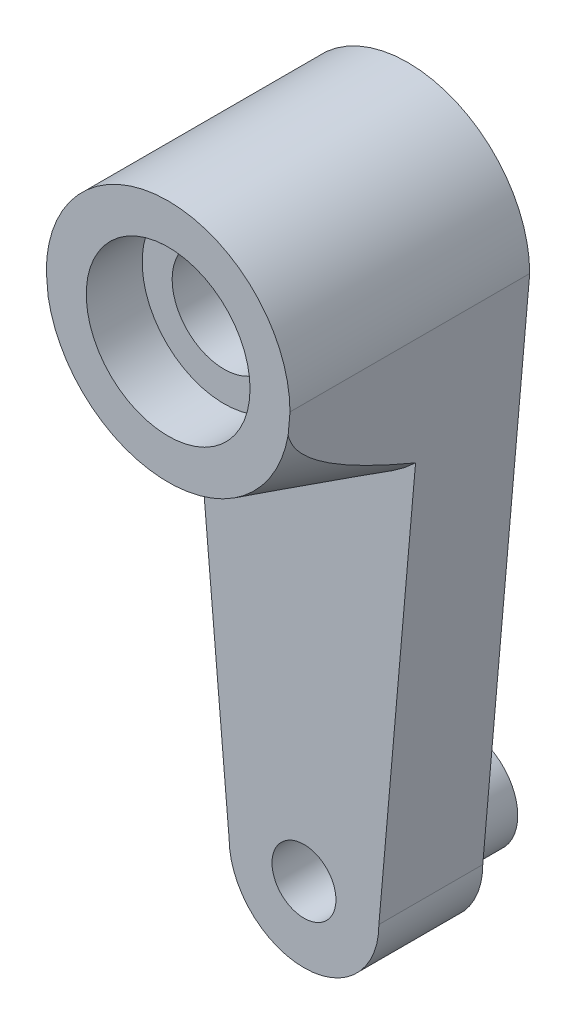
ISO-10303-21;
HEADER;
FILE_DESCRIPTION(('STEP AP214'),'2;1');
FILE_NAME('part.step','',(''),(''),'','','');
FILE_SCHEMA(('AUTOMOTIVE_DESIGN { 1 0 10303 214 1 1 1 1 }'));
ENDSEC;
DATA;
#1=APPLICATION_CONTEXT('core data for automotive mechanical design processes');
#2=APPLICATION_PROTOCOL_DEFINITION('international standard','automotive_design',2000,#1);
#3=PRODUCT_CONTEXT('',#1,'mechanical');
#4=PRODUCT('Part','Part','',(#3));
#5=PRODUCT_RELATED_PRODUCT_CATEGORY('part','',(#4));
#6=PRODUCT_DEFINITION_FORMATION('','',#4);
#7=PRODUCT_DEFINITION_CONTEXT('part definition',#1,'design');
#8=PRODUCT_DEFINITION('design','',#6,#7);
#9=PRODUCT_DEFINITION_SHAPE('','',#8);
#10=(LENGTH_UNIT() NAMED_UNIT(*) SI_UNIT(.MILLI.,.METRE.));
#11=(NAMED_UNIT(*) PLANE_ANGLE_UNIT() SI_UNIT($,.RADIAN.));
#12=(NAMED_UNIT(*) SI_UNIT($,.STERADIAN.) SOLID_ANGLE_UNIT());
#13=UNCERTAINTY_MEASURE_WITH_UNIT(LENGTH_MEASURE(1.E-05),#10,'distance_accuracy_value','');
#14=(GEOMETRIC_REPRESENTATION_CONTEXT(3) GLOBAL_UNCERTAINTY_ASSIGNED_CONTEXT((#13)) GLOBAL_UNIT_ASSIGNED_CONTEXT((#10,
#11,#12)) REPRESENTATION_CONTEXT('',''));
#15=CARTESIAN_POINT('',(0.,0.,0.));
#16=DIRECTION('',(0.,0.,1.));
#17=DIRECTION('',(1.,0.,0.));
#18=AXIS2_PLACEMENT_3D('',#15,#16,#17);
#19=CARTESIAN_POINT('',(0.,0.,12.));
#20=DIRECTION('',(0.,0.,-1.));
#21=DIRECTION('',(-1.,0.,0.));
#22=AXIS2_PLACEMENT_3D('',#19,#20,#21);
#23=CYLINDRICAL_SURFACE('',#22,2.6);
#24=CARTESIAN_POINT('',(0.,0.,2.8));
#25=DIRECTION('',(0.,0.,-1.));
#26=DIRECTION('',(-1.,0.,0.));
#27=AXIS2_PLACEMENT_3D('',#24,#25,#26);
#28=CIRCLE('',#27,2.6);
#29=CARTESIAN_POINT('',(-2.6,0.,2.8));
#30=VERTEX_POINT('',#29);
#31=EDGE_CURVE('E134',#30,#30,#28,.T.);
#32=ORIENTED_EDGE('',*,*,#31,.T.);
#33=EDGE_LOOP('',(#32));
#34=FACE_BOUND('',#33,.T.);
#35=CARTESIAN_POINT('',(0.,0.,9.2));
#36=DIRECTION('',(0.,0.,1.));
#37=DIRECTION('',(1.,0.,0.));
#38=AXIS2_PLACEMENT_3D('',#35,#36,#37);
#39=CIRCLE('',#38,2.6);
#40=CARTESIAN_POINT('',(2.6,0.,9.2));
#41=VERTEX_POINT('',#40);
#42=EDGE_CURVE('E265',#41,#41,#39,.T.);
#43=ORIENTED_EDGE('',*,*,#42,.T.);
#44=EDGE_LOOP('',(#43));
#45=FACE_BOUND('',#44,.T.);
#46=ADVANCED_FACE('F35',(#34,#45),#23,.F.);
#47=CARTESIAN_POINT('',(0.,-26.8,0.));
#48=DIRECTION('',(0.,0.,1.));
#49=DIRECTION('',(1.,0.,0.));
#50=AXIS2_PLACEMENT_3D('',#47,#48,#49);
#51=PLANE('',#50);
#52=CARTESIAN_POINT('',(0.,-26.8,0.));
#53=DIRECTION('',(0.,0.,1.));
#54=DIRECTION('',(1.,0.,0.));
#55=AXIS2_PLACEMENT_3D('',#52,#53,#54);
#56=CIRCLE('',#55,3.);
#57=CARTESIAN_POINT('',(3.,-26.8,0.));
#58=VERTEX_POINT('',#57);
#59=EDGE_CURVE('E140',#58,#58,#56,.T.);
#60=ORIENTED_EDGE('',*,*,#59,.T.);
#61=EDGE_LOOP('',(#60));
#62=FACE_BOUND('',#61,.T.);
#63=CARTESIAN_POINT('',(0.,-26.8,0.));
#64=DIRECTION('',(0.,0.,1.));
#65=DIRECTION('',(1.,0.,0.));
#66=AXIS2_PLACEMENT_3D('',#63,#64,#65);
#67=CIRCLE('',#66,3.75);
#68=CARTESIAN_POINT('',(-3.75,-26.8,0.));
#69=VERTEX_POINT('',#68);
#70=CARTESIAN_POINT('',(3.75,-26.8,0.));
#71=VERTEX_POINT('',#70);
#72=EDGE_CURVE('E133',#69,#71,#67,.T.);
#73=ORIENTED_EDGE('',*,*,#72,.F.);
#74=DIRECTION('',(0.0873513906763996,-0.996177561756386,0.));
#75=VECTOR('',#74,1.);
#76=CARTESIAN_POINT('',(-3.75,-26.8,0.));
#77=LINE('',#76,#75);
#78=CARTESIAN_POINT('',(-6.1,0.,0.));
#79=VERTEX_POINT('',#78);
#80=EDGE_CURVE('E113',#79,#69,#77,.T.);
#81=ORIENTED_EDGE('',*,*,#80,.F.);
#82=CARTESIAN_POINT('',(0.,0.,0.));
#83=DIRECTION('',(0.,0.,1.));
#84=DIRECTION('',(1.,0.,0.));
#85=AXIS2_PLACEMENT_3D('',#82,#83,#84);
#86=CIRCLE('',#85,6.1);
#87=CARTESIAN_POINT('',(6.1,0.,0.));
#88=VERTEX_POINT('',#87);
#89=EDGE_CURVE('E255',#88,#79,#86,.T.);
#90=ORIENTED_EDGE('',*,*,#89,.F.);
#91=DIRECTION('',(0.0873513906763996,0.996177561756386,0.));
#92=VECTOR('',#91,1.);
#93=CARTESIAN_POINT('',(6.1,0.,0.));
#94=LINE('',#93,#92);
#95=EDGE_CURVE('E254',#71,#88,#94,.T.);
#96=ORIENTED_EDGE('',*,*,#95,.F.);
#97=EDGE_LOOP('',(#73,#81,#90,#96));
#98=FACE_BOUND('',#97,.T.);
#99=CARTESIAN_POINT('',(0.,0.,0.));
#100=DIRECTION('',(0.,0.,-1.));
#101=DIRECTION('',(-1.,0.,0.));
#102=AXIS2_PLACEMENT_3D('',#99,#100,#101);
#103=CIRCLE('',#102,4.1);
#104=CARTESIAN_POINT('',(-4.1,0.,0.));
#105=VERTEX_POINT('',#104);
#106=EDGE_CURVE('E241',#105,#105,#103,.T.);
#107=ORIENTED_EDGE('',*,*,#106,.F.);
#108=EDGE_LOOP('',(#107));
#109=FACE_BOUND('',#108,.T.);
#110=ADVANCED_FACE('F152',(#62,#98,#109),#51,.F.);
#111=CARTESIAN_POINT('',(0.,-26.8,12.));
#112=DIRECTION('',(0.,0.,-1.));
#113=DIRECTION('',(-1.,0.,0.));
#114=AXIS2_PLACEMENT_3D('',#111,#112,#113);
#115=CYLINDRICAL_SURFACE('',#114,3.75);
#116=CARTESIAN_POINT('',(0.,-26.8,5.2));
#117=DIRECTION('',(0.,0.,1.));
#118=DIRECTION('',(1.,0.,0.));
#119=AXIS2_PLACEMENT_3D('',#116,#117,#118);
#120=CIRCLE('',#119,3.75);
#121=CARTESIAN_POINT('',(-3.75,-26.8,5.2));
#122=VERTEX_POINT('',#121);
#123=CARTESIAN_POINT('',(3.75,-26.8,5.2));
#124=VERTEX_POINT('',#123);
#125=EDGE_CURVE('E95',#122,#124,#120,.T.);
#126=ORIENTED_EDGE('',*,*,#125,.F.);
#127=DIRECTION('',(0.,0.,-1.));
#128=VECTOR('',#127,1.);
#129=CARTESIAN_POINT('',(-3.75,-26.8,12.));
#130=LINE('',#129,#128);
#131=EDGE_CURVE('E105',#122,#69,#130,.T.);
#132=ORIENTED_EDGE('',*,*,#131,.T.);
#133=ORIENTED_EDGE('',*,*,#72,.T.);
#134=DIRECTION('',(0.,0.,-1.));
#135=VECTOR('',#134,1.);
#136=CARTESIAN_POINT('',(3.75,-26.8,12.));
#137=LINE('',#136,#135);
#138=EDGE_CURVE('E107',#124,#71,#137,.T.);
#139=ORIENTED_EDGE('',*,*,#138,.F.);
#140=EDGE_LOOP('',(#126,#132,#133,#139));
#141=FACE_BOUND('',#140,.T.);
#142=ADVANCED_FACE('F103',(#141),#115,.T.);
#143=CARTESIAN_POINT('',(0.,-26.8,12.));
#144=DIRECTION('',(0.,0.,-1.));
#145=DIRECTION('',(-1.,0.,0.));
#146=AXIS2_PLACEMENT_3D('',#143,#144,#145);
#147=CYLINDRICAL_SURFACE('',#146,1.6);
#148=CARTESIAN_POINT('',(0.,-26.8,5.2));
#149=DIRECTION('',(0.,0.,1.));
#150=DIRECTION('',(1.,0.,0.));
#151=AXIS2_PLACEMENT_3D('',#148,#149,#150);
#152=CIRCLE('',#151,1.6);
#153=CARTESIAN_POINT('',(1.6,-26.8,5.2));
#154=VERTEX_POINT('',#153);
#155=EDGE_CURVE('E130',#154,#154,#152,.T.);
#156=ORIENTED_EDGE('',*,*,#155,.T.);
#157=EDGE_LOOP('',(#156));
#158=FACE_BOUND('',#157,.T.);
#159=CARTESIAN_POINT('',(0.,-26.8,-3.));
#160=DIRECTION('',(0.,0.,-1.));
#161=DIRECTION('',(-1.,0.,0.));
#162=AXIS2_PLACEMENT_3D('',#159,#160,#161);
#163=CIRCLE('',#162,1.6);
#164=CARTESIAN_POINT('',(-1.6,-26.8,-3.));
#165=VERTEX_POINT('',#164);
#166=EDGE_CURVE('E235',#165,#165,#163,.T.);
#167=ORIENTED_EDGE('',*,*,#166,.T.);
#168=EDGE_LOOP('',(#167));
#169=FACE_BOUND('',#168,.T.);
#170=ADVANCED_FACE('F162',(#158,#169),#147,.F.);
#171=CARTESIAN_POINT('',(0.,-26.8,12.));
#172=DIRECTION('',(0.,0.,1.));
#173=DIRECTION('',(1.,0.,0.));
#174=AXIS2_PLACEMENT_3D('',#171,#172,#173);
#175=PLANE('',#174);
#176=CARTESIAN_POINT('',(0.,0.,12.));
#177=DIRECTION('',(0.,0.,1.));
#178=DIRECTION('',(1.,0.,0.));
#179=AXIS2_PLACEMENT_3D('',#176,#177,#178);
#180=CIRCLE('',#179,4.1);
#181=CARTESIAN_POINT('',(4.1,0.,12.));
#182=VERTEX_POINT('',#181);
#183=EDGE_CURVE('E200',#182,#182,#180,.T.);
#184=ORIENTED_EDGE('',*,*,#183,.F.);
#185=EDGE_LOOP('',(#184));
#186=FACE_BOUND('',#185,.T.);
#187=CARTESIAN_POINT('',(0.,0.,12.));
#188=DIRECTION('',(0.,0.,-1.));
#189=DIRECTION('',(1.,0.,0.));
#190=AXIS2_PLACEMENT_3D('',#187,#188,#189);
#191=CIRCLE('',#190,6.1);
#192=CARTESIAN_POINT('',(6.00691076147217,-1.06161344363654,12.));
#193=VERTEX_POINT('',#192);
#194=CARTESIAN_POINT('',(-6.00691076147216,-1.06161344363656,12.));
#195=VERTEX_POINT('',#194);
#196=EDGE_CURVE('E99',#193,#195,#191,.T.);
#197=ORIENTED_EDGE('',*,*,#196,.F.);
#198=DIRECTION('',(0.0873513906763996,0.996177561756386,0.));
#199=VECTOR('',#198,1.);
#200=CARTESIAN_POINT('',(6.1,0.,12.));
#201=LINE('',#200,#199);
#202=CARTESIAN_POINT('',(6.1,0.,12.));
#203=VERTEX_POINT('',#202);
#204=EDGE_CURVE('E201',#193,#203,#201,.T.);
#205=ORIENTED_EDGE('',*,*,#204,.T.);
#206=CARTESIAN_POINT('',(0.,0.,12.));
#207=DIRECTION('',(0.,0.,1.));
#208=DIRECTION('',(1.,0.,0.));
#209=AXIS2_PLACEMENT_3D('',#206,#207,#208);
#210=CIRCLE('',#209,6.1);
#211=CARTESIAN_POINT('',(-6.1,0.,12.));
#212=VERTEX_POINT('',#211);
#213=EDGE_CURVE('E121',#203,#212,#210,.T.);
#214=ORIENTED_EDGE('',*,*,#213,.T.);
#215=DIRECTION('',(0.0873513906763996,-0.996177561756386,0.));
#216=VECTOR('',#215,1.);
#217=CARTESIAN_POINT('',(-3.75,-26.8,12.));
#218=LINE('',#217,#216);
#219=EDGE_CURVE('E116',#212,#195,#218,.T.);
#220=ORIENTED_EDGE('',*,*,#219,.T.);
#221=EDGE_LOOP('',(#197,#205,#214,#220));
#222=FACE_BOUND('',#221,.T.);
#223=ADVANCED_FACE('F160',(#186,#222),#175,.T.);
#224=CARTESIAN_POINT('',(6.1,0.,12.));
#225=DIRECTION('',(-0.996177561756386,0.0873513906763996,0.));
#226=DIRECTION('',(-0.0873513906763996,-0.996177561756386,0.));
#227=AXIS2_PLACEMENT_3D('',#224,#225,#226);
#228=PLANE('',#227);
#229=ORIENTED_EDGE('',*,*,#204,.F.);
#230=CARTESIAN_POINT('',(6.00691076147217,-1.06161344363654,11.9999999999999));
#231=CARTESIAN_POINT('',(5.99959290657591,-1.14506812926192,11.9751362120785));
#232=CARTESIAN_POINT('',(5.99243235980993,-1.22672883280593,11.9449550579355));
#233=CARTESIAN_POINT('',(5.97847258999629,-1.38592961195724,11.8758799471729));
#234=CARTESIAN_POINT('',(5.9716719683851,-1.4634856371401,11.8370233346673));
#235=CARTESIAN_POINT('',(5.95206059900039,-1.68713870076145,11.7116434654855));
#236=CARTESIAN_POINT('',(5.93974067235911,-1.8276382896918,11.6151440803784));
#237=CARTESIAN_POINT('',(5.91544789226449,-2.10467935630285,11.3977095441892));
#238=CARTESIAN_POINT('',(5.90356521581586,-2.2401924323979,11.2755087663683));
#239=CARTESIAN_POINT('',(5.88086373731854,-2.49908588930344,11.0186654610849));
#240=CARTESIAN_POINT('',(5.87004637830578,-2.6224498133639,10.8840065241381));
#241=CARTESIAN_POINT('',(5.84895494164729,-2.86298194206493,10.6024445651832));
#242=CARTESIAN_POINT('',(5.83870594811579,-2.97986408106249,10.4552988427259));
#243=CARTESIAN_POINT('',(5.81891825837843,-3.2055279470034,10.155098552462));
#244=CARTESIAN_POINT('',(5.80937907159271,-3.31431526864486,10.0020481788366));
#245=CARTESIAN_POINT('',(5.7887895818787,-3.54912306623438,9.65686973716205));
#246=CARTESIAN_POINT('',(5.77787859154305,-3.67355478580692,9.46365880553208));
#247=CARTESIAN_POINT('',(5.75670729540617,-3.91499765238915,9.0725965143645));
#248=CARTESIAN_POINT('',(5.74644714893255,-4.03200698238627,8.87474403468245));
#249=CARTESIAN_POINT('',(5.72643438988905,-4.26023759615891,8.4753369352528));
#250=CARTESIAN_POINT('',(5.71668253596197,-4.37145022817841,8.27377735671164));
#251=CARTESIAN_POINT('',(5.69760506355262,-4.58901459437863,7.86802950031072));
#252=CARTESIAN_POINT('',(5.68827946630312,-4.69536608641545,7.66384109215118));
#253=CARTESIAN_POINT('',(5.6708452773313,-4.89419002873236,7.27275622565568));
#254=CARTESIAN_POINT('',(5.66270485526182,-4.98702548041842,7.08604509495848));
#255=CARTESIAN_POINT('',(5.64667240975651,-5.16986358235132,6.71122496150826));
#256=CARTESIAN_POINT('',(5.63878039452783,-5.25986613900172,6.52311591282249));
#257=CARTESIAN_POINT('',(5.62323767587374,-5.43711927088675,6.14638500444436));
#258=CARTESIAN_POINT('',(5.61558623934931,-5.52437820656961,5.95776709992486));
#259=CARTESIAN_POINT('',(5.60047114905192,-5.69675455549297,5.57956788235996));
#260=CARTESIAN_POINT('',(5.59300747820272,-5.78187216347541,5.38998665882174));
#261=CARTESIAN_POINT('',(5.58562427825302,-5.86607206077407,5.20000000000024));
#262=B_SPLINE_CURVE_WITH_KNOTS('',3,(#230,#231,#232,#233,#234,#235,#236,#237,#238,#239,#240,
#241,#242,#243,#244,#245,#246,#247,#248,#249,#250,#251,#252,#253,#254,#255,#256,#257,#258,#259,
#260,#261),.UNSPECIFIED.,.F.,.F.,(4,2,2,2,2,2,2,2,2,2,2,2,2,2,2,4),(0.,0.261662991599174,
0.522220638804981,1.03265787208609,1.58016338965039,2.12840061963555,2.69264497011371,
3.25649565177873,3.94647814488239,4.63662890007615,5.32778184670859,6.01896918372797,
6.64497054759162,7.27099257234818,7.89487319806594,8.51869687865691),.UNSPECIFIED.);
#263=CARTESIAN_POINT('',(5.58562427825305,-5.86607206077372,5.2));
#264=VERTEX_POINT('',#263);
#265=EDGE_CURVE('E11',#193,#264,#262,.T.);
#266=ORIENTED_EDGE('',*,*,#265,.T.);
#267=DIRECTION('',(0.0873513906763995,0.996177561756386,0.));
#268=VECTOR('',#267,1.);
#269=CARTESIAN_POINT('',(3.75,-26.8,5.2));
#270=LINE('',#269,#268);
#271=EDGE_CURVE('E108',#124,#264,#270,.T.);
#272=ORIENTED_EDGE('',*,*,#271,.F.);
#273=ORIENTED_EDGE('',*,*,#138,.T.);
#274=ORIENTED_EDGE('',*,*,#95,.T.);
#275=DIRECTION('',(0.,0.,-1.));
#276=VECTOR('',#275,1.);
#277=CARTESIAN_POINT('',(6.1,0.,12.));
#278=LINE('',#277,#276);
#279=EDGE_CURVE('E118',#203,#88,#278,.T.);
#280=ORIENTED_EDGE('',*,*,#279,.F.);
#281=EDGE_LOOP('',(#229,#266,#272,#273,#274,#280));
#282=FACE_BOUND('',#281,.T.);
#283=ADVANCED_FACE('F155',(#282),#228,.F.);
#284=CARTESIAN_POINT('',(0.,0.,12.));
#285=DIRECTION('',(0.,0.,-1.));
#286=DIRECTION('',(-1.,0.,0.));
#287=AXIS2_PLACEMENT_3D('',#284,#285,#286);
#288=CYLINDRICAL_SURFACE('',#287,6.1);
#289=ORIENTED_EDGE('',*,*,#89,.T.);
#290=DIRECTION('',(0.,0.,-1.));
#291=VECTOR('',#290,1.);
#292=CARTESIAN_POINT('',(-6.1,0.,12.));
#293=LINE('',#292,#291);
#294=EDGE_CURVE('E115',#212,#79,#293,.T.);
#295=ORIENTED_EDGE('',*,*,#294,.F.);
#296=ORIENTED_EDGE('',*,*,#213,.F.);
#297=ORIENTED_EDGE('',*,*,#279,.T.);
#298=EDGE_LOOP('',(#289,#295,#296,#297));
#299=FACE_BOUND('',#298,.T.);
#300=ADVANCED_FACE('F151',(#299),#288,.T.);
#301=CARTESIAN_POINT('',(-3.75,-26.8,12.));
#302=DIRECTION('',(0.996177561756386,0.0873513906763996,0.));
#303=DIRECTION('',(-0.0873513906763996,0.996177561756386,0.));
#304=AXIS2_PLACEMENT_3D('',#301,#302,#303);
#305=PLANE('',#304);
#306=DIRECTION('',(0.0873513906763995,-0.996177561756386,0.));
#307=VECTOR('',#306,1.);
#308=CARTESIAN_POINT('',(-6.00691076147216,-1.06161344363656,5.2));
#309=LINE('',#308,#307);
#310=CARTESIAN_POINT('',(-5.58562427825305,-5.86607206077372,5.2));
#311=VERTEX_POINT('',#310);
#312=EDGE_CURVE('E92',#311,#122,#309,.T.);
#313=ORIENTED_EDGE('',*,*,#312,.F.);
#314=CARTESIAN_POINT('',(-5.58562427825305,-5.86607206077372,5.2));
#315=CARTESIAN_POINT('',(-5.59434514506542,-5.76661706904116,5.42438378803641));
#316=CARTESIAN_POINT('',(-5.60317723655505,-5.66589364269132,5.6482099576668));
#317=CARTESIAN_POINT('',(-5.62111137486906,-5.46136815042943,6.0945120190318));
#318=CARTESIAN_POINT('',(-5.63021349384723,-5.35756526165708,6.31698753037528));
#319=CARTESIAN_POINT('',(-5.64883791908311,-5.14516756109475,6.76280228207193));
#320=CARTESIAN_POINT('',(-5.65836387432059,-5.03653113540771,6.9861216138369));
#321=CARTESIAN_POINT('',(-5.67779783502799,-4.81490128563825,7.43053231746063));
#322=CARTESIAN_POINT('',(-5.68770578142968,-4.70190853518498,7.65162402716585));
#323=CARTESIAN_POINT('',(-5.70944460822561,-4.4539934040654,8.12258803313073));
#324=CARTESIAN_POINT('',(-5.72134719457467,-4.31825327038248,8.37202973582077));
#325=CARTESIAN_POINT('',(-5.74592887524451,-4.03791750784988,8.86581482069021));
#326=CARTESIAN_POINT('',(-5.75860783474846,-3.8933234164857,9.11015907821425));
#327=CARTESIAN_POINT('',(-5.78492773967148,-3.59316450076774,9.59039808117871));
#328=CARTESIAN_POINT('',(-5.79856356008484,-3.43765812328773,9.82632895510299));
#329=CARTESIAN_POINT('',(-5.82005604182989,-3.19255237402504,10.1715965643726));
#330=CARTESIAN_POINT('',(-5.82738966543826,-3.10891785798067,10.2851966762799));
#331=CARTESIAN_POINT('',(-5.84247287612226,-2.93690507230787,10.5087045190115));
#332=CARTESIAN_POINT('',(-5.85022235559141,-2.84852802985118,10.618613193175));
#333=CARTESIAN_POINT('',(-5.86426811239863,-2.68834663307088,10.8073280879161));
#334=CARTESIAN_POINT('',(-5.87045726070186,-2.6177640056128,10.8871765191717));
#335=CARTESIAN_POINT('',(-5.88316775938079,-2.47281023344455,11.0433959123622));
#336=CARTESIAN_POINT('',(-5.88968921146913,-2.39843792877761,11.1197657958603));
#337=CARTESIAN_POINT('',(-5.90299024397506,-2.24674955807161,11.2666520827408));
#338=CARTESIAN_POINT('',(-5.90976284096291,-2.16951313284851,11.337250492682));
#339=CARTESIAN_POINT('',(-5.92372477329436,-2.01028769179193,11.4727950199506));
#340=CARTESIAN_POINT('',(-5.93091404616239,-1.92829938844595,11.5377419810112));
#341=CARTESIAN_POINT('',(-5.94870707155432,-1.72538318397625,11.6845235089406));
#342=CARTESIAN_POINT('',(-5.95953838451033,-1.60186012558436,11.7629036495741));
#343=CARTESIAN_POINT('',(-5.97661485014044,-1.40711575158984,11.8650859117111));
#344=CARTESIAN_POINT('',(-5.98249946016059,-1.34000615646649,11.8967857182709));
#345=CARTESIAN_POINT('',(-5.99452181082918,-1.20290019990554,11.9536316168876));
#346=CARTESIAN_POINT('',(-6.00066016580246,-1.13289683255065,11.9787605767453));
#347=CARTESIAN_POINT('',(-6.00691076147217,-1.06161344363656,11.9999999999999));
#348=B_SPLINE_CURVE_WITH_KNOTS('',3,(#314,#315,#316,#317,#318,#319,#320,#321,#322,#323,#324,
#325,#326,#327,#328,#329,#330,#331,#332,#333,#334,#335,#336,#337,#338,#339,#340,#341,#342,#343,
#344,#345,#346,#347),.UNSPECIFIED.,.F.,.F.,(4,2,2,2,2,2,2,2,2,2,2,2,2,2,2,2,4),(0.,
0.736784059763212,1.47376680038016,2.21929708987836,2.96471255498133,3.81726327417893,
4.66966636589724,5.51780892800882,5.94148519066735,6.36505234697997,6.6852077828974,
7.00546180866916,7.3198064776732,7.63410413576225,8.07247337169373,8.29552192933702,
8.51914637094487),.UNSPECIFIED.);
#349=EDGE_CURVE('E48',#311,#195,#348,.T.);
#350=ORIENTED_EDGE('',*,*,#349,.T.);
#351=ORIENTED_EDGE('',*,*,#219,.F.);
#352=ORIENTED_EDGE('',*,*,#294,.T.);
#353=ORIENTED_EDGE('',*,*,#80,.T.);
#354=ORIENTED_EDGE('',*,*,#131,.F.);
#355=EDGE_LOOP('',(#313,#350,#351,#352,#353,#354));
#356=FACE_BOUND('',#355,.T.);
#357=ADVANCED_FACE('F110',(#356),#305,.F.);
#358=CARTESIAN_POINT('',(0.,0.,5.2));
#359=DIRECTION('',(0.,0.,1.));
#360=DIRECTION('',(1.,0.,0.));
#361=AXIS2_PLACEMENT_3D('',#358,#359,#360);
#362=PLANE('',#361);
#363=ORIENTED_EDGE('',*,*,#155,.F.);
#364=EDGE_LOOP('',(#363));
#365=FACE_BOUND('',#364,.T.);
#366=ORIENTED_EDGE('',*,*,#271,.T.);
#367=CARTESIAN_POINT('',(0.,0.,5.2));
#368=DIRECTION('',(0.,0.,1.));
#369=DIRECTION('',(1.,0.,0.));
#370=AXIS2_PLACEMENT_3D('',#367,#368,#369);
#371=CIRCLE('',#370,8.09999999999999);
#372=EDGE_CURVE('E96',#264,#311,#371,.F.);
#373=ORIENTED_EDGE('',*,*,#372,.T.);
#374=ORIENTED_EDGE('',*,*,#312,.T.);
#375=ORIENTED_EDGE('',*,*,#125,.T.);
#376=EDGE_LOOP('',(#366,#373,#374,#375));
#377=FACE_BOUND('',#376,.T.);
#378=ADVANCED_FACE('F94',(#365,#377),#362,.T.);
#379=CARTESIAN_POINT('',(0.,0.,2.8));
#380=DIRECTION('',(0.,0.,-1.));
#381=DIRECTION('',(-1.,0.,0.));
#382=AXIS2_PLACEMENT_3D('',#379,#380,#381);
#383=CYLINDRICAL_SURFACE('',#382,4.1);
#384=CARTESIAN_POINT('',(0.,0.,2.8));
#385=DIRECTION('',(0.,0.,-1.));
#386=DIRECTION('',(-1.,0.,0.));
#387=AXIS2_PLACEMENT_3D('',#384,#385,#386);
#388=CIRCLE('',#387,4.1);
#389=CARTESIAN_POINT('',(-4.1,0.,2.8));
#390=VERTEX_POINT('',#389);
#391=EDGE_CURVE('E137',#390,#390,#388,.T.);
#392=ORIENTED_EDGE('',*,*,#391,.F.);
#393=EDGE_LOOP('',(#392));
#394=FACE_BOUND('',#393,.T.);
#395=ORIENTED_EDGE('',*,*,#106,.T.);
#396=EDGE_LOOP('',(#395));
#397=FACE_BOUND('',#396,.T.);
#398=ADVANCED_FACE('F223',(#394,#397),#383,.F.);
#399=CARTESIAN_POINT('',(0.,0.,2.8));
#400=DIRECTION('',(0.,0.,-1.));
#401=DIRECTION('',(-1.,0.,0.));
#402=AXIS2_PLACEMENT_3D('',#399,#400,#401);
#403=PLANE('',#402);
#404=ORIENTED_EDGE('',*,*,#31,.F.);
#405=EDGE_LOOP('',(#404));
#406=FACE_BOUND('',#405,.T.);
#407=ORIENTED_EDGE('',*,*,#391,.T.);
#408=EDGE_LOOP('',(#407));
#409=FACE_BOUND('',#408,.T.);
#410=ADVANCED_FACE('F218',(#406,#409),#403,.T.);
#411=CARTESIAN_POINT('',(0.,-26.8,-3.));
#412=DIRECTION('',(0.,0.,-1.));
#413=DIRECTION('',(-1.,0.,0.));
#414=AXIS2_PLACEMENT_3D('',#411,#412,#413);
#415=PLANE('',#414);
#416=CARTESIAN_POINT('',(0.,-26.8,-3.));
#417=DIRECTION('',(0.,0.,-1.));
#418=DIRECTION('',(-1.,0.,0.));
#419=AXIS2_PLACEMENT_3D('',#416,#417,#418);
#420=CIRCLE('',#419,2.5);
#421=CARTESIAN_POINT('',(-2.5,-26.8,-3.));
#422=VERTEX_POINT('',#421);
#423=EDGE_CURVE('E237',#422,#422,#420,.T.);
#424=ORIENTED_EDGE('',*,*,#423,.T.);
#425=EDGE_LOOP('',(#424));
#426=FACE_BOUND('',#425,.T.);
#427=ORIENTED_EDGE('',*,*,#166,.F.);
#428=EDGE_LOOP('',(#427));
#429=FACE_BOUND('',#428,.T.);
#430=ADVANCED_FACE('F175',(#426,#429),#415,.T.);
#431=CARTESIAN_POINT('',(0.,-26.8,-3.));
#432=DIRECTION('',(0.,0.,1.));
#433=DIRECTION('',(1.,0.,0.));
#434=AXIS2_PLACEMENT_3D('',#431,#432,#433);
#435=CYLINDRICAL_SURFACE('',#434,2.5);
#436=CARTESIAN_POINT('',(0.,-26.8,-0.499999999999999));
#437=DIRECTION('',(0.,0.,1.));
#438=DIRECTION('',(1.,0.,0.));
#439=AXIS2_PLACEMENT_3D('',#436,#437,#438);
#440=CIRCLE('',#439,2.5);
#441=CARTESIAN_POINT('',(2.5,-26.8,-0.499999999999999));
#442=VERTEX_POINT('',#441);
#443=EDGE_CURVE('E129',#442,#442,#440,.F.);
#444=ORIENTED_EDGE('',*,*,#443,.T.);
#445=EDGE_LOOP('',(#444));
#446=FACE_BOUND('',#445,.T.);
#447=ORIENTED_EDGE('',*,*,#423,.F.);
#448=EDGE_LOOP('',(#447));
#449=FACE_BOUND('',#448,.T.);
#450=ADVANCED_FACE('F166',(#446,#449),#435,.T.);
#451=CARTESIAN_POINT('',(0.,-26.8,-0.499999999999999));
#452=DIRECTION('',(0.,0.,1.));
#453=DIRECTION('',(1.,0.,0.));
#454=AXIS2_PLACEMENT_3D('',#451,#452,#453);
#455=CONICAL_SURFACE('',#454,2.5,0.785398163397448);
#456=ORIENTED_EDGE('',*,*,#59,.F.);
#457=EDGE_LOOP('',(#456));
#458=FACE_BOUND('',#457,.T.);
#459=ORIENTED_EDGE('',*,*,#443,.F.);
#460=EDGE_LOOP('',(#459));
#461=FACE_BOUND('',#460,.T.);
#462=ADVANCED_FACE('F163',(#458,#461),#455,.T.);
#463=CARTESIAN_POINT('',(0.,0.,9.2));
#464=DIRECTION('',(0.,0.,1.));
#465=DIRECTION('',(1.,0.,0.));
#466=AXIS2_PLACEMENT_3D('',#463,#464,#465);
#467=CYLINDRICAL_SURFACE('',#466,4.1);
#468=CARTESIAN_POINT('',(0.,0.,9.2));
#469=DIRECTION('',(0.,0.,1.));
#470=DIRECTION('',(1.,0.,0.));
#471=AXIS2_PLACEMENT_3D('',#468,#469,#470);
#472=CIRCLE('',#471,4.1);
#473=CARTESIAN_POINT('',(4.1,0.,9.2));
#474=VERTEX_POINT('',#473);
#475=EDGE_CURVE('E238',#474,#474,#472,.T.);
#476=ORIENTED_EDGE('',*,*,#475,.F.);
#477=EDGE_LOOP('',(#476));
#478=FACE_BOUND('',#477,.T.);
#479=ORIENTED_EDGE('',*,*,#183,.T.);
#480=EDGE_LOOP('',(#479));
#481=FACE_BOUND('',#480,.T.);
#482=ADVANCED_FACE('F165',(#478,#481),#467,.F.);
#483=CARTESIAN_POINT('',(0.,0.,9.2));
#484=DIRECTION('',(0.,0.,1.));
#485=DIRECTION('',(1.,0.,0.));
#486=AXIS2_PLACEMENT_3D('',#483,#484,#485);
#487=PLANE('',#486);
#488=ORIENTED_EDGE('',*,*,#42,.F.);
#489=EDGE_LOOP('',(#488));
#490=FACE_BOUND('',#489,.T.);
#491=ORIENTED_EDGE('',*,*,#475,.T.);
#492=EDGE_LOOP('',(#491));
#493=FACE_BOUND('',#492,.T.);
#494=ADVANCED_FACE('F172',(#490,#493),#487,.T.);
#495=CARTESIAN_POINT('',(0.,0.,5.2));
#496=DIRECTION('',(0.,0.,-1.));
#497=DIRECTION('',(-1.,0.,0.));
#498=AXIS2_PLACEMENT_3D('',#495,#496,#497);
#499=CONICAL_SURFACE('',#498,8.09999999999999,0.286051441717321);
#500=ORIENTED_EDGE('',*,*,#265,.F.);
#501=ORIENTED_EDGE('',*,*,#196,.T.);
#502=ORIENTED_EDGE('',*,*,#349,.F.);
#503=ORIENTED_EDGE('',*,*,#372,.F.);
#504=EDGE_LOOP('',(#500,#501,#502,#503));
#505=FACE_BOUND('',#504,.T.);
#506=ADVANCED_FACE('F37',(#505),#499,.T.);
#507=CLOSED_SHELL('',(#46,#110,#142,#170,#223,#283,#300,#357,#378,#398,#410,#430,#450,#462,#482,
#494,#506));
#508=MANIFOLD_SOLID_BREP('B2',#507);
#509=ADVANCED_BREP_SHAPE_REPRESENTATION('',(#18,#508),#14);
#510=SHAPE_DEFINITION_REPRESENTATION(#9,#509);
ENDSEC;
END-ISO-10303-21;
